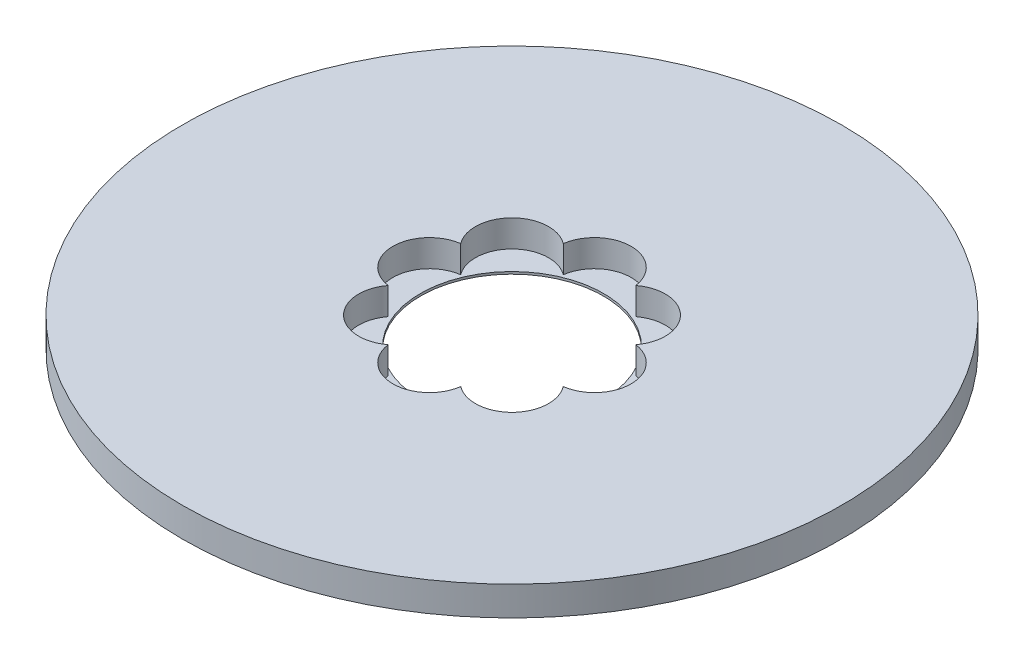
ISO-10303-21;
HEADER;
FILE_DESCRIPTION(('STEP AP214'),'2;1');
FILE_NAME('part.step','',(''),(''),'','','');
FILE_SCHEMA(('AUTOMOTIVE_DESIGN { 1 0 10303 214 1 1 1 1 }'));
ENDSEC;
DATA;
#1=APPLICATION_CONTEXT('core data for automotive mechanical design processes');
#2=APPLICATION_PROTOCOL_DEFINITION('international standard','automotive_design',2000,#1);
#3=PRODUCT_CONTEXT('',#1,'mechanical');
#4=PRODUCT('Part','Part','',(#3));
#5=PRODUCT_RELATED_PRODUCT_CATEGORY('part','',(#4));
#6=PRODUCT_DEFINITION_FORMATION('','',#4);
#7=PRODUCT_DEFINITION_CONTEXT('part definition',#1,'design');
#8=PRODUCT_DEFINITION('design','',#6,#7);
#9=PRODUCT_DEFINITION_SHAPE('','',#8);
#10=(LENGTH_UNIT() NAMED_UNIT(*) SI_UNIT(.MILLI.,.METRE.));
#11=(NAMED_UNIT(*) PLANE_ANGLE_UNIT() SI_UNIT($,.RADIAN.));
#12=(NAMED_UNIT(*) SI_UNIT($,.STERADIAN.) SOLID_ANGLE_UNIT());
#13=UNCERTAINTY_MEASURE_WITH_UNIT(LENGTH_MEASURE(1.E-05),#10,'distance_accuracy_value','');
#14=(GEOMETRIC_REPRESENTATION_CONTEXT(3) GLOBAL_UNCERTAINTY_ASSIGNED_CONTEXT((#13)) GLOBAL_UNIT_ASSIGNED_CONTEXT((#10,
#11,#12)) REPRESENTATION_CONTEXT('',''));
#15=CARTESIAN_POINT('',(0.,0.,0.));
#16=DIRECTION('',(0.,0.,1.));
#17=DIRECTION('',(1.,0.,0.));
#18=AXIS2_PLACEMENT_3D('',#15,#16,#17);
#19=CARTESIAN_POINT('',(0.,8.,0.));
#20=DIRECTION('',(0.,-1.,0.));
#21=DIRECTION('',(0.,0.,-1.));
#22=AXIS2_PLACEMENT_3D('',#19,#20,#21);
#23=CYLINDRICAL_SURFACE('',#22,25.);
#24=CARTESIAN_POINT('',(0.,0.,0.));
#25=DIRECTION('',(0.,1.,0.));
#26=DIRECTION('',(0.,0.,1.));
#27=AXIS2_PLACEMENT_3D('',#24,#25,#26);
#28=CIRCLE('',#27,25.);
#29=CARTESIAN_POINT('',(0.,0.,25.));
#30=VERTEX_POINT('',#29);
#31=EDGE_CURVE('E166',#30,#30,#28,.T.);
#32=ORIENTED_EDGE('',*,*,#31,.F.);
#33=EDGE_LOOP('',(#32));
#34=FACE_BOUND('',#33,.T.);
#35=CARTESIAN_POINT('',(0.,0.631075583167885,0.));
#36=DIRECTION('',(0.,1.,0.));
#37=DIRECTION('',(0.,0.,1.));
#38=AXIS2_PLACEMENT_3D('',#35,#36,#37);
#39=CIRCLE('',#38,25.);
#40=CARTESIAN_POINT('',(0.,0.631075583167885,25.));
#41=VERTEX_POINT('',#40);
#42=EDGE_CURVE('E11',#41,#41,#39,.T.);
#43=ORIENTED_EDGE('',*,*,#42,.T.);
#44=EDGE_LOOP('',(#43));
#45=FACE_BOUND('',#44,.T.);
#46=ADVANCED_FACE('F39',(#34,#45),#23,.F.);
#47=CARTESIAN_POINT('',(0.,8.,0.));
#48=DIRECTION('',(0.,-1.,0.));
#49=DIRECTION('',(0.,0.,-1.));
#50=AXIS2_PLACEMENT_3D('',#47,#48,#49);
#51=CYLINDRICAL_SURFACE('',#50,90.);
#52=CARTESIAN_POINT('',(0.,8.,0.));
#53=DIRECTION('',(0.,1.,0.));
#54=DIRECTION('',(0.,0.,1.));
#55=AXIS2_PLACEMENT_3D('',#52,#53,#54);
#56=CIRCLE('',#55,90.);
#57=CARTESIAN_POINT('',(0.,8.,90.));
#58=VERTEX_POINT('',#57);
#59=EDGE_CURVE('E50',#58,#58,#56,.T.);
#60=ORIENTED_EDGE('',*,*,#59,.F.);
#61=EDGE_LOOP('',(#60));
#62=FACE_BOUND('',#61,.T.);
#63=CARTESIAN_POINT('',(0.,0.,0.));
#64=DIRECTION('',(0.,1.,0.));
#65=DIRECTION('',(0.,0.,1.));
#66=AXIS2_PLACEMENT_3D('',#63,#64,#65);
#67=CIRCLE('',#66,90.);
#68=CARTESIAN_POINT('',(0.,0.,90.));
#69=VERTEX_POINT('',#68);
#70=EDGE_CURVE('E173',#69,#69,#67,.T.);
#71=ORIENTED_EDGE('',*,*,#70,.T.);
#72=EDGE_LOOP('',(#71));
#73=FACE_BOUND('',#72,.T.);
#74=ADVANCED_FACE('F41',(#62,#73),#51,.T.);
#75=CARTESIAN_POINT('',(0.,8.,0.));
#76=DIRECTION('',(0.,1.,0.));
#77=DIRECTION('',(0.,0.,1.));
#78=AXIS2_PLACEMENT_3D('',#75,#76,#77);
#79=PLANE('',#78);
#80=CARTESIAN_POINT('',(-15.9342445286083,8.,15.9342445286084));
#81=DIRECTION('',(0.,1.,0.));
#82=DIRECTION('',(0.707106781186549,0.,0.707106781186546));
#83=AXIS2_PLACEMENT_3D('',#80,#81,#82);
#84=CIRCLE('',#83,10.);
#85=CARTESIAN_POINT('',(-23.9119731180386,8.,9.9046635685925));
#86=VERTEX_POINT('',#85);
#87=CARTESIAN_POINT('',(-9.90466356859241,8.,23.9119731180387));
#88=VERTEX_POINT('',#87);
#89=EDGE_CURVE('E159',#86,#88,#84,.T.);
#90=ORIENTED_EDGE('',*,*,#89,.F.);
#91=CARTESIAN_POINT('',(-22.5344247185272,8.,0.));
#92=DIRECTION('',(0.,1.,0.));
#93=DIRECTION('',(0.,0.,1.));
#94=AXIS2_PLACEMENT_3D('',#91,#92,#93);
#95=CIRCLE('',#94,10.);
#96=CARTESIAN_POINT('',(-23.911973118039,8.,-9.90466356859245));
#97=VERTEX_POINT('',#96);
#98=EDGE_CURVE('E167',#97,#86,#95,.T.);
#99=ORIENTED_EDGE('',*,*,#98,.F.);
#100=CARTESIAN_POINT('',(-15.9342445286085,8.,-15.9342445286081));
#101=DIRECTION('',(0.,1.,0.));
#102=DIRECTION('',(-0.707106781186539,0.,0.707106781186556));
#103=AXIS2_PLACEMENT_3D('',#100,#101,#102);
#104=CIRCLE('',#103,10.);
#105=CARTESIAN_POINT('',(-9.90466356859275,8.,-23.9119731180385));
#106=VERTEX_POINT('',#105);
#107=EDGE_CURVE('E53',#106,#97,#104,.T.);
#108=ORIENTED_EDGE('',*,*,#107,.F.);
#109=CARTESIAN_POINT('',(-2.36035570158909E-13,8.,-22.5344247185272));
#110=DIRECTION('',(0.,1.,0.));
#111=DIRECTION('',(-1.,0.,0.));
#112=AXIS2_PLACEMENT_3D('',#109,#110,#111);
#113=CIRCLE('',#112,10.);
#114=CARTESIAN_POINT('',(9.90466356859224,8.,-23.9119731180387));
#115=VERTEX_POINT('',#114);
#116=EDGE_CURVE('E117',#115,#106,#113,.T.);
#117=ORIENTED_EDGE('',*,*,#116,.F.);
#118=CARTESIAN_POINT('',(15.9342445286082,8.,-15.9342445286085));
#119=DIRECTION('',(0.,1.,0.));
#120=DIRECTION('',(-0.707106781186554,0.,-0.707106781186541));
#121=AXIS2_PLACEMENT_3D('',#118,#119,#120);
#122=CIRCLE('',#121,10.);
#123=CARTESIAN_POINT('',(23.9119731180385,8.,-9.90466356859252));
#124=VERTEX_POINT('',#123);
#125=EDGE_CURVE('E120',#124,#115,#122,.T.);
#126=ORIENTED_EDGE('',*,*,#125,.F.);
#127=CARTESIAN_POINT('',(22.5344247185272,8.,0.));
#128=DIRECTION('',(0.,1.,0.));
#129=DIRECTION('',(0.,0.,-1.));
#130=AXIS2_PLACEMENT_3D('',#127,#128,#129);
#131=CIRCLE('',#130,10.);
#132=CARTESIAN_POINT('',(23.9119731180388,8.,9.90466356859247));
#133=VERTEX_POINT('',#132);
#134=EDGE_CURVE('E136',#133,#124,#131,.T.);
#135=ORIENTED_EDGE('',*,*,#134,.F.);
#136=CARTESIAN_POINT('',(15.9342445286084,8.,15.9342445286082));
#137=DIRECTION('',(0.,1.,0.));
#138=DIRECTION('',(0.707106781186544,0.,-0.707106781186551));
#139=AXIS2_PLACEMENT_3D('',#136,#137,#138);
#140=CIRCLE('',#139,10.);
#141=CARTESIAN_POINT('',(9.90466356859258,8.,23.9119731180386));
#142=VERTEX_POINT('',#141);
#143=EDGE_CURVE('E138',#142,#133,#140,.T.);
#144=ORIENTED_EDGE('',*,*,#143,.F.);
#145=CARTESIAN_POINT('',(0.,8.,22.5344247185272));
#146=DIRECTION('',(0.,1.,0.));
#147=DIRECTION('',(1.,0.,0.));
#148=AXIS2_PLACEMENT_3D('',#145,#146,#147);
#149=CIRCLE('',#148,10.);
#150=EDGE_CURVE('E146',#88,#142,#149,.T.);
#151=ORIENTED_EDGE('',*,*,#150,.F.);
#152=EDGE_LOOP('',(#90,#99,#108,#117,#126,#135,#144,#151));
#153=FACE_BOUND('',#152,.T.);
#154=ORIENTED_EDGE('',*,*,#59,.T.);
#155=EDGE_LOOP('',(#154));
#156=FACE_BOUND('',#155,.T.);
#157=ADVANCED_FACE('F181',(#153,#156),#79,.T.);
#158=CARTESIAN_POINT('',(0.,0.,0.));
#159=DIRECTION('',(0.,1.,0.));
#160=DIRECTION('',(0.,0.,1.));
#161=AXIS2_PLACEMENT_3D('',#158,#159,#160);
#162=PLANE('',#161);
#163=ORIENTED_EDGE('',*,*,#31,.T.);
#164=EDGE_LOOP('',(#163));
#165=FACE_BOUND('',#164,.T.);
#166=ORIENTED_EDGE('',*,*,#70,.F.);
#167=EDGE_LOOP('',(#166));
#168=FACE_BOUND('',#167,.T.);
#169=ADVANCED_FACE('F179',(#165,#168),#162,.F.);
#170=CARTESIAN_POINT('',(-22.5344247185272,0.631075583167885,0.));
#171=DIRECTION('',(0.,1.,0.));
#172=DIRECTION('',(0.,0.,1.));
#173=AXIS2_PLACEMENT_3D('',#170,#171,#172);
#174=CYLINDRICAL_SURFACE('',#173,10.);
#175=ORIENTED_EDGE('',*,*,#98,.T.);
#176=DIRECTION('',(0.,1.,0.));
#177=VECTOR('',#176,1.);
#178=CARTESIAN_POINT('',(-23.9119731180386,4.31553779158394,9.9046635685925));
#179=LINE('',#178,#177);
#180=CARTESIAN_POINT('',(-23.9119731180386,0.631075583167885,9.9046635685925));
#181=VERTEX_POINT('',#180);
#182=EDGE_CURVE('E65',#86,#181,#179,.F.);
#183=ORIENTED_EDGE('',*,*,#182,.T.);
#184=CARTESIAN_POINT('',(-22.5344247185272,0.631075583167885,0.));
#185=DIRECTION('',(0.,1.,0.));
#186=DIRECTION('',(0.,0.,1.));
#187=AXIS2_PLACEMENT_3D('',#184,#185,#186);
#188=CIRCLE('',#187,10.);
#189=CARTESIAN_POINT('',(-23.911973118039,0.631075583167885,-9.90466356859245));
#190=VERTEX_POINT('',#189);
#191=EDGE_CURVE('E170',#190,#181,#188,.T.);
#192=ORIENTED_EDGE('',*,*,#191,.F.);
#193=DIRECTION('',(0.,1.,0.));
#194=VECTOR('',#193,1.);
#195=CARTESIAN_POINT('',(-23.911973118039,4.31553779158394,-9.90466356859245));
#196=LINE('',#195,#194);
#197=EDGE_CURVE('E124',#190,#97,#196,.T.);
#198=ORIENTED_EDGE('',*,*,#197,.T.);
#199=EDGE_LOOP('',(#175,#183,#192,#198));
#200=FACE_BOUND('',#199,.T.);
#201=ADVANCED_FACE('F185',(#200),#174,.F.);
#202=CARTESIAN_POINT('',(-22.5344247185272,0.631075583167885,0.));
#203=DIRECTION('',(0.,1.,0.));
#204=DIRECTION('',(0.,0.,1.));
#205=AXIS2_PLACEMENT_3D('',#202,#203,#204);
#206=PLANE('',#205);
#207=CARTESIAN_POINT('',(-15.9342445286085,0.631075583167885,-15.9342445286081));
#208=DIRECTION('',(0.,1.,0.));
#209=DIRECTION('',(-0.707106781186539,0.,0.707106781186556));
#210=AXIS2_PLACEMENT_3D('',#207,#208,#209);
#211=CIRCLE('',#210,10.);
#212=CARTESIAN_POINT('',(-9.90466356859275,0.631075583167885,-23.9119731180385));
#213=VERTEX_POINT('',#212);
#214=EDGE_CURVE('E112',#213,#190,#211,.T.);
#215=ORIENTED_EDGE('',*,*,#214,.T.);
#216=ORIENTED_EDGE('',*,*,#191,.T.);
#217=CARTESIAN_POINT('',(-15.9342445286083,0.631075583167885,15.9342445286084));
#218=DIRECTION('',(0.,1.,0.));
#219=DIRECTION('',(0.707106781186549,0.,0.707106781186546));
#220=AXIS2_PLACEMENT_3D('',#217,#218,#219);
#221=CIRCLE('',#220,10.);
#222=CARTESIAN_POINT('',(-9.90466356859241,0.631075583167885,23.9119731180387));
#223=VERTEX_POINT('',#222);
#224=EDGE_CURVE('E161',#181,#223,#221,.T.);
#225=ORIENTED_EDGE('',*,*,#224,.T.);
#226=CARTESIAN_POINT('',(0.,0.631075583167885,22.5344247185272));
#227=DIRECTION('',(0.,1.,0.));
#228=DIRECTION('',(1.,0.,0.));
#229=AXIS2_PLACEMENT_3D('',#226,#227,#228);
#230=CIRCLE('',#229,10.);
#231=CARTESIAN_POINT('',(9.90466356859258,0.631075583167885,23.9119731180386));
#232=VERTEX_POINT('',#231);
#233=EDGE_CURVE('E149',#223,#232,#230,.T.);
#234=ORIENTED_EDGE('',*,*,#233,.T.);
#235=CARTESIAN_POINT('',(15.9342445286084,0.631075583167885,15.9342445286082));
#236=DIRECTION('',(0.,1.,0.));
#237=DIRECTION('',(0.707106781186544,0.,-0.707106781186551));
#238=AXIS2_PLACEMENT_3D('',#235,#236,#237);
#239=CIRCLE('',#238,10.);
#240=CARTESIAN_POINT('',(23.9119731180388,0.631075583167885,9.90466356859247));
#241=VERTEX_POINT('',#240);
#242=EDGE_CURVE('E143',#232,#241,#239,.T.);
#243=ORIENTED_EDGE('',*,*,#242,.T.);
#244=CARTESIAN_POINT('',(22.5344247185272,0.631075583167885,0.));
#245=DIRECTION('',(0.,1.,0.));
#246=DIRECTION('',(0.,0.,-1.));
#247=AXIS2_PLACEMENT_3D('',#244,#245,#246);
#248=CIRCLE('',#247,10.);
#249=CARTESIAN_POINT('',(23.9119731180385,0.631075583167885,-9.90466356859252));
#250=VERTEX_POINT('',#249);
#251=EDGE_CURVE('E140',#241,#250,#248,.T.);
#252=ORIENTED_EDGE('',*,*,#251,.T.);
#253=CARTESIAN_POINT('',(15.9342445286082,0.631075583167885,-15.9342445286085));
#254=DIRECTION('',(0.,1.,0.));
#255=DIRECTION('',(-0.707106781186554,0.,-0.707106781186541));
#256=AXIS2_PLACEMENT_3D('',#253,#254,#255);
#257=CIRCLE('',#256,10.);
#258=CARTESIAN_POINT('',(9.90466356859225,0.631075583167885,-23.9119731180387));
#259=VERTEX_POINT('',#258);
#260=EDGE_CURVE('E111',#250,#259,#257,.T.);
#261=ORIENTED_EDGE('',*,*,#260,.T.);
#262=CARTESIAN_POINT('',(-2.36035570158909E-13,0.631075583167885,-22.5344247185272));
#263=DIRECTION('',(0.,1.,0.));
#264=DIRECTION('',(-1.,0.,0.));
#265=AXIS2_PLACEMENT_3D('',#262,#263,#264);
#266=CIRCLE('',#265,10.);
#267=EDGE_CURVE('E104',#259,#213,#266,.T.);
#268=ORIENTED_EDGE('',*,*,#267,.T.);
#269=EDGE_LOOP('',(#215,#216,#225,#234,#243,#252,#261,#268));
#270=FACE_BOUND('',#269,.T.);
#271=ORIENTED_EDGE('',*,*,#42,.F.);
#272=EDGE_LOOP('',(#271));
#273=FACE_BOUND('',#272,.T.);
#274=ADVANCED_FACE('F110',(#270,#273),#206,.T.);
#275=CARTESIAN_POINT('',(-15.9342445286083,0.631075583167885,15.9342445286084));
#276=DIRECTION('',(0.,1.,0.));
#277=DIRECTION('',(0.,0.,1.));
#278=AXIS2_PLACEMENT_3D('',#275,#276,#277);
#279=CYLINDRICAL_SURFACE('',#278,10.);
#280=ORIENTED_EDGE('',*,*,#89,.T.);
#281=DIRECTION('',(0.,1.,0.));
#282=VECTOR('',#281,1.);
#283=CARTESIAN_POINT('',(-9.90466356859241,4.31553779158394,23.9119731180387));
#284=LINE('',#283,#282);
#285=EDGE_CURVE('E160',#88,#223,#284,.F.);
#286=ORIENTED_EDGE('',*,*,#285,.T.);
#287=ORIENTED_EDGE('',*,*,#224,.F.);
#288=ORIENTED_EDGE('',*,*,#182,.F.);
#289=EDGE_LOOP('',(#280,#286,#287,#288));
#290=FACE_BOUND('',#289,.T.);
#291=ADVANCED_FACE('F202',(#290),#279,.F.);
#292=CARTESIAN_POINT('',(-15.9342445286085,0.631075583167885,-15.9342445286081));
#293=DIRECTION('',(0.,1.,0.));
#294=DIRECTION('',(0.,0.,1.));
#295=AXIS2_PLACEMENT_3D('',#292,#293,#294);
#296=CYLINDRICAL_SURFACE('',#295,10.);
#297=ORIENTED_EDGE('',*,*,#214,.F.);
#298=DIRECTION('',(0.,1.,0.));
#299=VECTOR('',#298,1.);
#300=CARTESIAN_POINT('',(-9.90466356859275,4.31553779158394,-23.9119731180385));
#301=LINE('',#300,#299);
#302=EDGE_CURVE('E119',#106,#213,#301,.F.);
#303=ORIENTED_EDGE('',*,*,#302,.F.);
#304=ORIENTED_EDGE('',*,*,#107,.T.);
#305=ORIENTED_EDGE('',*,*,#197,.F.);
#306=EDGE_LOOP('',(#297,#303,#304,#305));
#307=FACE_BOUND('',#306,.T.);
#308=ADVANCED_FACE('F123',(#307),#296,.F.);
#309=CARTESIAN_POINT('',(0.,0.631075583167885,22.5344247185272));
#310=DIRECTION('',(0.,1.,0.));
#311=DIRECTION('',(0.,0.,1.));
#312=AXIS2_PLACEMENT_3D('',#309,#310,#311);
#313=CYLINDRICAL_SURFACE('',#312,10.);
#314=ORIENTED_EDGE('',*,*,#150,.T.);
#315=DIRECTION('',(0.,1.,0.));
#316=VECTOR('',#315,1.);
#317=CARTESIAN_POINT('',(9.90466356859258,4.31553779158394,23.9119731180386));
#318=LINE('',#317,#316);
#319=EDGE_CURVE('E141',#142,#232,#318,.F.);
#320=ORIENTED_EDGE('',*,*,#319,.T.);
#321=ORIENTED_EDGE('',*,*,#233,.F.);
#322=ORIENTED_EDGE('',*,*,#285,.F.);
#323=EDGE_LOOP('',(#314,#320,#321,#322));
#324=FACE_BOUND('',#323,.T.);
#325=ADVANCED_FACE('F208',(#324),#313,.F.);
#326=CARTESIAN_POINT('',(15.9342445286084,0.631075583167885,15.9342445286082));
#327=DIRECTION('',(0.,1.,0.));
#328=DIRECTION('',(0.,0.,1.));
#329=AXIS2_PLACEMENT_3D('',#326,#327,#328);
#330=CYLINDRICAL_SURFACE('',#329,10.);
#331=DIRECTION('',(0.,1.,0.));
#332=VECTOR('',#331,1.);
#333=CARTESIAN_POINT('',(23.9119731180388,4.31553779158394,9.90466356859247));
#334=LINE('',#333,#332);
#335=EDGE_CURVE('E151',#133,#241,#334,.F.);
#336=ORIENTED_EDGE('',*,*,#335,.T.);
#337=ORIENTED_EDGE('',*,*,#242,.F.);
#338=ORIENTED_EDGE('',*,*,#319,.F.);
#339=ORIENTED_EDGE('',*,*,#143,.T.);
#340=EDGE_LOOP('',(#336,#337,#338,#339));
#341=FACE_BOUND('',#340,.T.);
#342=ADVANCED_FACE('F211',(#341),#330,.F.);
#343=CARTESIAN_POINT('',(22.5344247185272,0.631075583167885,0.));
#344=DIRECTION('',(0.,1.,0.));
#345=DIRECTION('',(0.,0.,1.));
#346=AXIS2_PLACEMENT_3D('',#343,#344,#345);
#347=CYLINDRICAL_SURFACE('',#346,10.);
#348=ORIENTED_EDGE('',*,*,#134,.T.);
#349=DIRECTION('',(0.,1.,0.));
#350=VECTOR('',#349,1.);
#351=CARTESIAN_POINT('',(23.9119731180385,4.31553779158394,-9.90466356859252));
#352=LINE('',#351,#350);
#353=EDGE_CURVE('E131',#124,#250,#352,.F.);
#354=ORIENTED_EDGE('',*,*,#353,.T.);
#355=ORIENTED_EDGE('',*,*,#251,.F.);
#356=ORIENTED_EDGE('',*,*,#335,.F.);
#357=EDGE_LOOP('',(#348,#354,#355,#356));
#358=FACE_BOUND('',#357,.T.);
#359=ADVANCED_FACE('F214',(#358),#347,.F.);
#360=CARTESIAN_POINT('',(15.9342445286082,0.631075583167885,-15.9342445286085));
#361=DIRECTION('',(0.,1.,0.));
#362=DIRECTION('',(0.,0.,1.));
#363=AXIS2_PLACEMENT_3D('',#360,#361,#362);
#364=CYLINDRICAL_SURFACE('',#363,10.);
#365=DIRECTION('',(0.,1.,0.));
#366=VECTOR('',#365,1.);
#367=CARTESIAN_POINT('',(9.90466356859225,4.31553779158394,-23.9119731180387));
#368=LINE('',#367,#366);
#369=EDGE_CURVE('E154',#115,#259,#368,.F.);
#370=ORIENTED_EDGE('',*,*,#369,.T.);
#371=ORIENTED_EDGE('',*,*,#260,.F.);
#372=ORIENTED_EDGE('',*,*,#353,.F.);
#373=ORIENTED_EDGE('',*,*,#125,.T.);
#374=EDGE_LOOP('',(#370,#371,#372,#373));
#375=FACE_BOUND('',#374,.T.);
#376=ADVANCED_FACE('F218',(#375),#364,.F.);
#377=CARTESIAN_POINT('',(-2.36035570158909E-13,0.631075583167885,-22.5344247185272));
#378=DIRECTION('',(0.,1.,0.));
#379=DIRECTION('',(0.,0.,1.));
#380=AXIS2_PLACEMENT_3D('',#377,#378,#379);
#381=CYLINDRICAL_SURFACE('',#380,10.);
#382=ORIENTED_EDGE('',*,*,#116,.T.);
#383=ORIENTED_EDGE('',*,*,#302,.T.);
#384=ORIENTED_EDGE('',*,*,#267,.F.);
#385=ORIENTED_EDGE('',*,*,#369,.F.);
#386=EDGE_LOOP('',(#382,#383,#384,#385));
#387=FACE_BOUND('',#386,.T.);
#388=ADVANCED_FACE('F121',(#387),#381,.F.);
#389=CLOSED_SHELL('',(#46,#74,#157,#169,#201,#274,#291,#308,#325,#342,#359,#376,#388));
#390=MANIFOLD_SOLID_BREP('B2',#389);
#391=ADVANCED_BREP_SHAPE_REPRESENTATION('',(#18,#390),#14);
#392=SHAPE_DEFINITION_REPRESENTATION(#9,#391);
ENDSEC;
END-ISO-10303-21;
